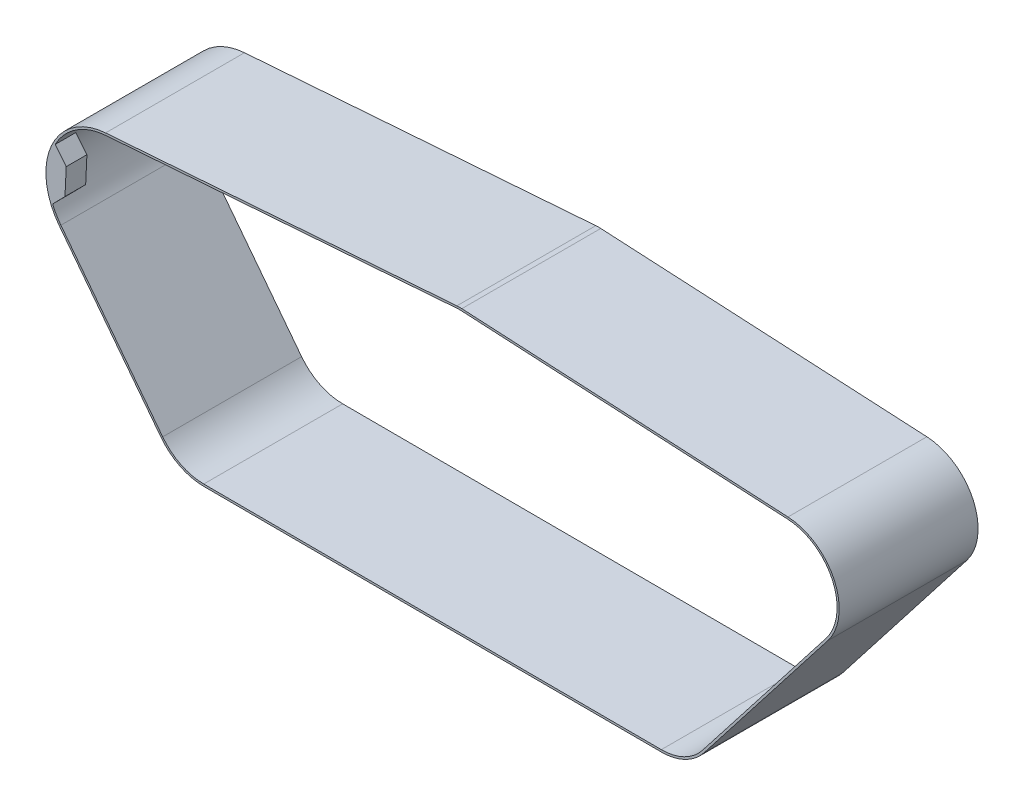
ISO-10303-21;
HEADER;
FILE_DESCRIPTION(('STEP AP214'),'2;1');
FILE_NAME('part.step','',(''),(''),'','','');
FILE_SCHEMA(('AUTOMOTIVE_DESIGN { 1 0 10303 214 1 1 1 1 }'));
ENDSEC;
DATA;
#1=APPLICATION_CONTEXT('core data for automotive mechanical design processes');
#2=APPLICATION_PROTOCOL_DEFINITION('international standard','automotive_design',2000,#1);
#3=PRODUCT_CONTEXT('',#1,'mechanical');
#4=PRODUCT('Part','Part','',(#3));
#5=PRODUCT_RELATED_PRODUCT_CATEGORY('part','',(#4));
#6=PRODUCT_DEFINITION_FORMATION('','',#4);
#7=PRODUCT_DEFINITION_CONTEXT('part definition',#1,'design');
#8=PRODUCT_DEFINITION('design','',#6,#7);
#9=PRODUCT_DEFINITION_SHAPE('','',#8);
#10=(LENGTH_UNIT() NAMED_UNIT(*) SI_UNIT(.MILLI.,.METRE.));
#11=(NAMED_UNIT(*) PLANE_ANGLE_UNIT() SI_UNIT($,.RADIAN.));
#12=(NAMED_UNIT(*) SI_UNIT($,.STERADIAN.) SOLID_ANGLE_UNIT());
#13=UNCERTAINTY_MEASURE_WITH_UNIT(LENGTH_MEASURE(1.E-05),#10,'distance_accuracy_value','');
#14=(GEOMETRIC_REPRESENTATION_CONTEXT(3) GLOBAL_UNCERTAINTY_ASSIGNED_CONTEXT((#13)) GLOBAL_UNIT_ASSIGNED_CONTEXT((#10,
#11,#12)) REPRESENTATION_CONTEXT('',''));
#15=CARTESIAN_POINT('',(0.,0.,0.));
#16=DIRECTION('',(0.,0.,1.));
#17=DIRECTION('',(1.,0.,0.));
#18=AXIS2_PLACEMENT_3D('',#15,#16,#17);
#19=CARTESIAN_POINT('',(2.22044604925031E-13,-1.346145417358E-12,23.5));
#20=DIRECTION('',(0.,0.,-1.));
#21=DIRECTION('',(-1.,0.,0.));
#22=AXIS2_PLACEMENT_3D('',#19,#20,#21);
#23=PLANE('',#22);
#24=DIRECTION('',(-0.630975539281231,0.77580272545845,0.));
#25=VECTOR('',#24,1.);
#26=CARTESIAN_POINT('',(-14.9213563464373,5.19549081248599,23.5));
#27=LINE('',#26,#25);
#28=CARTESIAN_POINT('',(-14.9213563464373,5.19549081248599,23.5));
#29=VERTEX_POINT('',#28);
#30=CARTESIAN_POINT('',(-18.6783253055227,9.81479310943626,23.5));
#31=VERTEX_POINT('',#30);
#32=EDGE_CURVE('E260',#29,#31,#27,.T.);
#33=ORIENTED_EDGE('',*,*,#32,.T.);
#34=CARTESIAN_POINT('',(2.22044604925031E-13,-1.346145417358E-12,23.5));
#35=DIRECTION('',(0.,0.,1.));
#36=DIRECTION('',(-1.,0.,0.));
#37=AXIS2_PLACEMENT_3D('',#34,#35,#36);
#38=CIRCLE('',#37,21.1);
#39=CARTESIAN_POINT('',(-1.55097310581208,21.0429200070948,23.5));
#40=VERTEX_POINT('',#39);
#41=EDGE_CURVE('E283',#40,#31,#38,.T.);
#42=ORIENTED_EDGE('',*,*,#41,.F.);
#43=DIRECTION('',(-0.997294787066168,-0.0735058343986872,0.));
#44=VECTOR('',#43,1.);
#45=CARTESIAN_POINT('',(-1.55097310581208,21.0429200070948,23.5));
#46=LINE('',#45,#44);
#47=CARTESIAN_POINT('',(117.314961243243,29.80396017217,23.5));
#48=VERTEX_POINT('',#47);
#49=EDGE_CURVE('E303',#48,#40,#46,.T.);
#50=ORIENTED_EDGE('',*,*,#49,.F.);
#51=CARTESIAN_POINT('',(118.241134756666,17.2380458551363,23.5));
#52=DIRECTION('',(0.,0.,1.));
#53=DIRECTION('',(-1.,0.,0.));
#54=AXIS2_PLACEMENT_3D('',#51,#52,#53);
#55=CIRCLE('',#54,12.6);
#56=CARTESIAN_POINT('',(118.910043209272,29.8202778305067,23.5));
#57=VERTEX_POINT('',#56);
#58=EDGE_CURVE('E300',#57,#48,#55,.T.);
#59=ORIENTED_EDGE('',*,*,#58,.F.);
#60=DIRECTION('',(-0.998589839315109,0.0530879724290279,0.));
#61=VECTOR('',#60,1.);
#62=CARTESIAN_POINT('',(118.910043209272,29.8202778305067,23.5));
#63=LINE('',#62,#61);
#64=CARTESIAN_POINT('',(229.262463920801,23.9536186301405,23.5));
#65=VERTEX_POINT('',#64);
#66=EDGE_CURVE('E298',#65,#57,#63,.T.);
#67=ORIENTED_EDGE('',*,*,#66,.F.);
#68=CARTESIAN_POINT('',(228.32811560605,6.37843745819464,23.5));
#69=DIRECTION('',(0.,0.,1.));
#70=DIRECTION('',(-1.,0.,0.));
#71=AXIS2_PLACEMENT_3D('',#68,#69,#70);
#72=CIRCLE('',#71,17.6);
#73=CARTESIAN_POINT('',(242.216182798249,-4.43274146294826,23.5));
#74=VERTEX_POINT('',#73);
#75=EDGE_CURVE('E296',#74,#65,#72,.T.);
#76=ORIENTED_EDGE('',*,*,#75,.F.);
#77=DIRECTION('',(0.614271529610392,0.789094726829491,0.));
#78=VECTOR('',#77,1.);
#79=CARTESIAN_POINT('',(242.216182798249,-4.43274146294826,23.5));
#80=LINE('',#79,#78);
#81=CARTESIAN_POINT('',(200.382727568324,-58.1721015598242,23.5));
#82=VERTEX_POINT('',#81);
#83=EDGE_CURVE('E294',#82,#74,#80,.T.);
#84=ORIENTED_EDGE('',*,*,#83,.F.);
#85=CARTESIAN_POINT('',(186.494660376125,-47.3609226386814,23.5));
#86=DIRECTION('',(0.,0.,1.));
#87=DIRECTION('',(-1.,0.,0.));
#88=AXIS2_PLACEMENT_3D('',#85,#86,#87);
#89=CIRCLE('',#88,17.6);
#90=CARTESIAN_POINT('',(186.445806411781,-64.9608548342941,23.5));
#91=VERTEX_POINT('',#90);
#92=EDGE_CURVE('E292',#91,#82,#89,.T.);
#93=ORIENTED_EDGE('',*,*,#92,.F.);
#94=DIRECTION('',(0.999996147478,-0.00277579342864236,0.));
#95=VECTOR('',#94,1.);
#96=CARTESIAN_POINT('',(186.445806411781,-64.9608548342941,23.5));
#97=LINE('',#96,#95);
#98=CARTESIAN_POINT('',(31.6218920570478,-64.5310939745684,23.5));
#99=VERTEX_POINT('',#98);
#100=EDGE_CURVE('E290',#99,#91,#97,.T.);
#101=ORIENTED_EDGE('',*,*,#100,.F.);
#102=CARTESIAN_POINT('',(31.6707460213919,-46.9311617789556,23.5));
#103=DIRECTION('',(0.,0.,1.));
#104=DIRECTION('',(-1.,0.,0.));
#105=AXIS2_PLACEMENT_3D('',#102,#103,#104);
#106=CIRCLE('',#105,17.6);
#107=CARTESIAN_POINT('',(17.7183914297212,-57.6592464797904,23.5));
#108=VERTEX_POINT('',#107);
#109=EDGE_CURVE('E288',#108,#99,#106,.T.);
#110=ORIENTED_EDGE('',*,*,#109,.F.);
#111=DIRECTION('',(0.609550267092885,-0.792747419981291,0.));
#112=VECTOR('',#111,1.);
#113=CARTESIAN_POINT('',(17.7183914297212,-57.6592464797904,23.5));
#114=LINE('',#113,#112);
#115=CARTESIAN_POINT('',(-16.726970561605,-12.8615106356612,23.5));
#116=VERTEX_POINT('',#115);
#117=EDGE_CURVE('E285',#116,#108,#114,.T.);
#118=ORIENTED_EDGE('',*,*,#117,.F.);
#119=CARTESIAN_POINT('',(-19.5159661992279,-8.02103879248869,23.5));
#120=VERTEX_POINT('',#119);
#121=EDGE_CURVE('E286',#120,#116,#38,.T.);
#122=ORIENTED_EDGE('',*,*,#121,.F.);
#123=DIRECTION('',(0.700907424340915,0.713252257272127,0.));
#124=VECTOR('',#123,1.);
#125=CARTESIAN_POINT('',(-15.3426072138043,-3.77417592103409,23.5));
#126=LINE('',#125,#124);
#127=CARTESIAN_POINT('',(-15.3426072138043,-3.77417592103409,23.5));
#128=VERTEX_POINT('',#127);
#129=EDGE_CURVE('E276',#120,#128,#126,.T.);
#130=ORIENTED_EDGE('',*,*,#129,.T.);
#131=DIRECTION('',(0.0469122308634259,0.998899015213959,0.));
#132=VECTOR('',#131,1.);
#133=CARTESIAN_POINT('',(-15.3426072138043,-3.77417592103409,23.5));
#134=LINE('',#133,#132);
#135=EDGE_CURVE('E266',#128,#29,#134,.T.);
#136=ORIENTED_EDGE('',*,*,#135,.T.);
#137=EDGE_LOOP('',(#33,#42,#50,#59,#67,#76,#84,#93,#101,#110,#118,#122,#130,#136));
#138=FACE_BOUND('',#137,.T.);
#139=CARTESIAN_POINT('',(2.22044604925031E-13,-1.346145417358E-12,23.5));
#140=DIRECTION('',(0.,0.,-1.));
#141=DIRECTION('',(-1.,0.,0.));
#142=AXIS2_PLACEMENT_3D('',#139,#140,#141);
#143=CIRCLE('',#142,21.8);
#144=CARTESIAN_POINT('',(-1.60242718989116,21.7410263580411,23.5));
#145=VERTEX_POINT('',#144);
#146=CARTESIAN_POINT('',(-17.2818937555919,-13.2881958226262,23.5));
#147=VERTEX_POINT('',#146);
#148=EDGE_CURVE('E357',#145,#147,#143,.F.);
#149=ORIENTED_EDGE('',*,*,#148,.T.);
#150=DIRECTION('',(0.609550267092885,-0.792747419981291,0.));
#151=VECTOR('',#150,1.);
#152=CARTESIAN_POINT('',(-17.2818937555919,-13.2881958226262,23.5));
#153=LINE('',#152,#151);
#154=CARTESIAN_POINT('',(17.1634682357343,-58.0859316667554,23.5));
#155=VERTEX_POINT('',#154);
#156=EDGE_CURVE('E359',#147,#155,#153,.T.);
#157=ORIENTED_EDGE('',*,*,#156,.T.);
#158=CARTESIAN_POINT('',(31.6707460213919,-46.9311617789556,23.5));
#159=DIRECTION('',(0.,0.,-1.));
#160=DIRECTION('',(-1.,0.,0.));
#161=AXIS2_PLACEMENT_3D('',#158,#159,#160);
#162=CIRCLE('',#161,18.3);
#163=CARTESIAN_POINT('',(31.6199490016477,-65.231091277803,23.5));
#164=VERTEX_POINT('',#163);
#165=EDGE_CURVE('E362',#155,#164,#162,.F.);
#166=ORIENTED_EDGE('',*,*,#165,.T.);
#167=DIRECTION('',(0.999996147478,-0.00277579342864236,0.));
#168=VECTOR('',#167,1.);
#169=CARTESIAN_POINT('',(-0.180823704314236,-65.1428185618275,23.5));
#170=LINE('',#169,#168);
#171=CARTESIAN_POINT('',(186.443863356381,-65.6608521375287,23.5));
#172=VERTEX_POINT('',#171);
#173=EDGE_CURVE('E364',#164,#172,#170,.T.);
#174=ORIENTED_EDGE('',*,*,#173,.T.);
#175=CARTESIAN_POINT('',(186.494660376125,-47.3609226386814,23.5));
#176=DIRECTION('',(0.,0.,-1.));
#177=DIRECTION('',(-1.,0.,0.));
#178=AXIS2_PLACEMENT_3D('',#175,#176,#177);
#179=CIRCLE('',#178,18.3);
#180=CARTESIAN_POINT('',(200.935093877105,-58.6020916305515,23.5));
#181=VERTEX_POINT('',#180);
#182=EDGE_CURVE('E366',#172,#181,#179,.F.);
#183=ORIENTED_EDGE('',*,*,#182,.T.);
#184=DIRECTION('',(0.614271529610392,0.789094726829491,0.));
#185=VECTOR('',#184,1.);
#186=CARTESIAN_POINT('',(153.521866491209,-119.509240845017,23.5));
#187=LINE('',#186,#185);
#188=CARTESIAN_POINT('',(242.76854910703,-4.86273153367553,23.5));
#189=VERTEX_POINT('',#188);
#190=EDGE_CURVE('E368',#181,#189,#187,.T.);
#191=ORIENTED_EDGE('',*,*,#190,.T.);
#192=CARTESIAN_POINT('',(228.32811560605,6.37843745819464,23.5));
#193=DIRECTION('',(0.,0.,-1.));
#194=DIRECTION('',(-1.,0.,0.));
#195=AXIS2_PLACEMENT_3D('',#192,#193,#194);
#196=CIRCLE('',#195,18.3);
#197=CARTESIAN_POINT('',(229.299625501501,24.6526315176611,23.5));
#198=VERTEX_POINT('',#197);
#199=EDGE_CURVE('E370',#189,#198,#196,.F.);
#200=ORIENTED_EDGE('',*,*,#199,.T.);
#201=DIRECTION('',(-0.998589839315109,0.053087972429028,0.));
#202=VECTOR('',#201,1.);
#203=CARTESIAN_POINT('',(1.9531553223125,36.7390384342261,23.5));
#204=LINE('',#203,#202);
#205=CARTESIAN_POINT('',(118.947204789972,30.5192907180273,23.5));
#206=VERTEX_POINT('',#205);
#207=EDGE_CURVE('E372',#198,#206,#204,.T.);
#208=ORIENTED_EDGE('',*,*,#207,.T.);
#209=CARTESIAN_POINT('',(118.241134756666,17.2380458551363,23.5));
#210=DIRECTION('',(0.,0.,-1.));
#211=DIRECTION('',(-1.,0.,0.));
#212=AXIS2_PLACEMENT_3D('',#209,#210,#211);
#213=CIRCLE('',#212,13.3);
#214=CARTESIAN_POINT('',(117.263507159164,30.5020665231164,23.5));
#215=VERTEX_POINT('',#214);
#216=EDGE_CURVE('E374',#206,#215,#213,.F.);
#217=ORIENTED_EDGE('',*,*,#216,.T.);
#218=DIRECTION('',(-0.997294787066168,-0.0735058343986872,0.));
#219=VECTOR('',#218,1.);
#220=CARTESIAN_POINT('',(-1.60242718989116,21.7410263580411,23.5));
#221=LINE('',#220,#219);
#222=EDGE_CURVE('E376',#215,#145,#221,.T.);
#223=ORIENTED_EDGE('',*,*,#222,.T.);
#224=EDGE_LOOP('',(#149,#157,#166,#174,#183,#191,#200,#208,#217,#223));
#225=FACE_BOUND('',#224,.T.);
#226=ADVANCED_FACE('F93',(#138,#225),#23,.F.);
#227=CARTESIAN_POINT('',(2.22044604925031E-13,-1.346145417358E-12,-23.5));
#228=DIRECTION('',(0.,0.,-1.));
#229=DIRECTION('',(-1.,0.,0.));
#230=AXIS2_PLACEMENT_3D('',#227,#228,#229);
#231=PLANE('',#230);
#232=CARTESIAN_POINT('',(2.22044604925031E-13,-1.346145417358E-12,-23.5));
#233=DIRECTION('',(0.,0.,-1.));
#234=DIRECTION('',(-1.,0.,0.));
#235=AXIS2_PLACEMENT_3D('',#232,#233,#234);
#236=CIRCLE('',#235,21.8);
#237=CARTESIAN_POINT('',(-1.60242718989116,21.7410263580411,-23.5));
#238=VERTEX_POINT('',#237);
#239=CARTESIAN_POINT('',(-17.2818937555919,-13.2881958226262,-23.5));
#240=VERTEX_POINT('',#239);
#241=EDGE_CURVE('E356',#238,#240,#236,.F.);
#242=ORIENTED_EDGE('',*,*,#241,.F.);
#243=DIRECTION('',(-0.997294787066168,-0.0735058343986872,0.));
#244=VECTOR('',#243,1.);
#245=CARTESIAN_POINT('',(-1.60242718989116,21.7410263580411,-23.5));
#246=LINE('',#245,#244);
#247=CARTESIAN_POINT('',(117.263507159164,30.5020665231164,-23.5));
#248=VERTEX_POINT('',#247);
#249=EDGE_CURVE('E360',#248,#238,#246,.T.);
#250=ORIENTED_EDGE('',*,*,#249,.F.);
#251=CARTESIAN_POINT('',(118.241134756666,17.2380458551363,-23.5));
#252=DIRECTION('',(0.,0.,-1.));
#253=DIRECTION('',(-1.,0.,0.));
#254=AXIS2_PLACEMENT_3D('',#251,#252,#253);
#255=CIRCLE('',#254,13.3);
#256=CARTESIAN_POINT('',(118.947204789972,30.5192907180273,-23.5));
#257=VERTEX_POINT('',#256);
#258=EDGE_CURVE('E395',#257,#248,#255,.F.);
#259=ORIENTED_EDGE('',*,*,#258,.F.);
#260=DIRECTION('',(-0.998589839315109,0.053087972429028,0.));
#261=VECTOR('',#260,1.);
#262=CARTESIAN_POINT('',(1.9531553223125,36.7390384342261,-23.5));
#263=LINE('',#262,#261);
#264=CARTESIAN_POINT('',(229.299625501501,24.6526315176611,-23.5));
#265=VERTEX_POINT('',#264);
#266=EDGE_CURVE('E393',#265,#257,#263,.T.);
#267=ORIENTED_EDGE('',*,*,#266,.F.);
#268=CARTESIAN_POINT('',(228.32811560605,6.37843745819464,-23.5));
#269=DIRECTION('',(0.,0.,-1.));
#270=DIRECTION('',(-1.,0.,0.));
#271=AXIS2_PLACEMENT_3D('',#268,#269,#270);
#272=CIRCLE('',#271,18.3);
#273=CARTESIAN_POINT('',(242.76854910703,-4.86273153367553,-23.5));
#274=VERTEX_POINT('',#273);
#275=EDGE_CURVE('E391',#274,#265,#272,.F.);
#276=ORIENTED_EDGE('',*,*,#275,.F.);
#277=DIRECTION('',(0.614271529610392,0.789094726829491,0.));
#278=VECTOR('',#277,1.);
#279=CARTESIAN_POINT('',(153.521866491209,-119.509240845017,-23.5));
#280=LINE('',#279,#278);
#281=CARTESIAN_POINT('',(200.935093877105,-58.6020916305515,-23.5));
#282=VERTEX_POINT('',#281);
#283=EDGE_CURVE('E389',#282,#274,#280,.T.);
#284=ORIENTED_EDGE('',*,*,#283,.F.);
#285=CARTESIAN_POINT('',(186.494660376125,-47.3609226386814,-23.5));
#286=DIRECTION('',(0.,0.,-1.));
#287=DIRECTION('',(-1.,0.,0.));
#288=AXIS2_PLACEMENT_3D('',#285,#286,#287);
#289=CIRCLE('',#288,18.3);
#290=CARTESIAN_POINT('',(186.443863356381,-65.6608521375287,-23.5));
#291=VERTEX_POINT('',#290);
#292=EDGE_CURVE('E387',#291,#282,#289,.F.);
#293=ORIENTED_EDGE('',*,*,#292,.F.);
#294=DIRECTION('',(0.999996147478,-0.00277579342864236,0.));
#295=VECTOR('',#294,1.);
#296=CARTESIAN_POINT('',(-0.180823704314236,-65.1428185618275,-23.5));
#297=LINE('',#296,#295);
#298=CARTESIAN_POINT('',(31.6199490016477,-65.231091277803,-23.5));
#299=VERTEX_POINT('',#298);
#300=EDGE_CURVE('E385',#299,#291,#297,.T.);
#301=ORIENTED_EDGE('',*,*,#300,.F.);
#302=CARTESIAN_POINT('',(31.6707460213919,-46.9311617789556,-23.5));
#303=DIRECTION('',(0.,0.,-1.));
#304=DIRECTION('',(-1.,0.,0.));
#305=AXIS2_PLACEMENT_3D('',#302,#303,#304);
#306=CIRCLE('',#305,18.3);
#307=CARTESIAN_POINT('',(17.1634682357343,-58.0859316667554,-23.5));
#308=VERTEX_POINT('',#307);
#309=EDGE_CURVE('E383',#308,#299,#306,.F.);
#310=ORIENTED_EDGE('',*,*,#309,.F.);
#311=DIRECTION('',(0.609550267092885,-0.792747419981291,0.));
#312=VECTOR('',#311,1.);
#313=CARTESIAN_POINT('',(-17.2818937555919,-13.2881958226262,-23.5));
#314=LINE('',#313,#312);
#315=EDGE_CURVE('E381',#240,#308,#314,.T.);
#316=ORIENTED_EDGE('',*,*,#315,.F.);
#317=EDGE_LOOP('',(#242,#250,#259,#267,#276,#284,#293,#301,#310,#316));
#318=FACE_BOUND('',#317,.T.);
#319=DIRECTION('',(-0.997294787066168,-0.0735058343986872,0.));
#320=VECTOR('',#319,1.);
#321=CARTESIAN_POINT('',(-1.55097310581208,21.0429200070948,-23.5));
#322=LINE('',#321,#320);
#323=CARTESIAN_POINT('',(117.314961243243,29.80396017217,-23.5));
#324=VERTEX_POINT('',#323);
#325=CARTESIAN_POINT('',(-1.55097310581208,21.0429200070948,-23.5));
#326=VERTEX_POINT('',#325);
#327=EDGE_CURVE('E332',#324,#326,#322,.T.);
#328=ORIENTED_EDGE('',*,*,#327,.T.);
#329=CARTESIAN_POINT('',(2.22044604925031E-13,-1.346145417358E-12,-23.5));
#330=DIRECTION('',(0.,0.,1.));
#331=DIRECTION('',(-1.,0.,0.));
#332=AXIS2_PLACEMENT_3D('',#329,#330,#331);
#333=CIRCLE('',#332,21.1);
#334=CARTESIAN_POINT('',(-16.726970561605,-12.8615106356612,-23.5));
#335=VERTEX_POINT('',#334);
#336=EDGE_CURVE('E281',#326,#335,#333,.T.);
#337=ORIENTED_EDGE('',*,*,#336,.T.);
#338=DIRECTION('',(0.609550267092885,-0.792747419981291,0.));
#339=VECTOR('',#338,1.);
#340=CARTESIAN_POINT('',(17.7183914297212,-57.6592464797904,-23.5));
#341=LINE('',#340,#339);
#342=CARTESIAN_POINT('',(17.7183914297212,-57.6592464797904,-23.5));
#343=VERTEX_POINT('',#342);
#344=EDGE_CURVE('E308',#335,#343,#341,.T.);
#345=ORIENTED_EDGE('',*,*,#344,.T.);
#346=CARTESIAN_POINT('',(31.6707460213919,-46.9311617789556,-23.5));
#347=DIRECTION('',(0.,0.,1.));
#348=DIRECTION('',(-1.,0.,0.));
#349=AXIS2_PLACEMENT_3D('',#346,#347,#348);
#350=CIRCLE('',#349,17.6);
#351=CARTESIAN_POINT('',(31.6218920570478,-64.5310939745684,-23.5));
#352=VERTEX_POINT('',#351);
#353=EDGE_CURVE('E311',#343,#352,#350,.T.);
#354=ORIENTED_EDGE('',*,*,#353,.T.);
#355=DIRECTION('',(0.999996147478,-0.00277579342864236,0.));
#356=VECTOR('',#355,1.);
#357=CARTESIAN_POINT('',(186.445806411781,-64.9608548342941,-23.5));
#358=LINE('',#357,#356);
#359=CARTESIAN_POINT('',(186.445806411781,-64.9608548342941,-23.5));
#360=VERTEX_POINT('',#359);
#361=EDGE_CURVE('E314',#352,#360,#358,.T.);
#362=ORIENTED_EDGE('',*,*,#361,.T.);
#363=CARTESIAN_POINT('',(186.494660376125,-47.3609226386814,-23.5));
#364=DIRECTION('',(0.,0.,1.));
#365=DIRECTION('',(-1.,0.,0.));
#366=AXIS2_PLACEMENT_3D('',#363,#364,#365);
#367=CIRCLE('',#366,17.6);
#368=CARTESIAN_POINT('',(200.382727568324,-58.1721015598242,-23.5));
#369=VERTEX_POINT('',#368);
#370=EDGE_CURVE('E317',#360,#369,#367,.T.);
#371=ORIENTED_EDGE('',*,*,#370,.T.);
#372=DIRECTION('',(0.614271529610392,0.789094726829491,0.));
#373=VECTOR('',#372,1.);
#374=CARTESIAN_POINT('',(242.216182798249,-4.43274146294826,-23.5));
#375=LINE('',#374,#373);
#376=CARTESIAN_POINT('',(242.216182798249,-4.43274146294826,-23.5));
#377=VERTEX_POINT('',#376);
#378=EDGE_CURVE('E320',#369,#377,#375,.T.);
#379=ORIENTED_EDGE('',*,*,#378,.T.);
#380=CARTESIAN_POINT('',(228.32811560605,6.37843745819464,-23.5));
#381=DIRECTION('',(0.,0.,1.));
#382=DIRECTION('',(-1.,0.,0.));
#383=AXIS2_PLACEMENT_3D('',#380,#381,#382);
#384=CIRCLE('',#383,17.6);
#385=CARTESIAN_POINT('',(229.262463920801,23.9536186301405,-23.5));
#386=VERTEX_POINT('',#385);
#387=EDGE_CURVE('E323',#377,#386,#384,.T.);
#388=ORIENTED_EDGE('',*,*,#387,.T.);
#389=DIRECTION('',(-0.998589839315109,0.0530879724290279,0.));
#390=VECTOR('',#389,1.);
#391=CARTESIAN_POINT('',(118.910043209272,29.8202778305067,-23.5));
#392=LINE('',#391,#390);
#393=CARTESIAN_POINT('',(118.910043209272,29.8202778305067,-23.5));
#394=VERTEX_POINT('',#393);
#395=EDGE_CURVE('E326',#386,#394,#392,.T.);
#396=ORIENTED_EDGE('',*,*,#395,.T.);
#397=CARTESIAN_POINT('',(118.241134756666,17.2380458551363,-23.5));
#398=DIRECTION('',(0.,0.,1.));
#399=DIRECTION('',(-1.,0.,0.));
#400=AXIS2_PLACEMENT_3D('',#397,#398,#399);
#401=CIRCLE('',#400,12.6);
#402=EDGE_CURVE('E329',#394,#324,#401,.T.);
#403=ORIENTED_EDGE('',*,*,#402,.T.);
#404=EDGE_LOOP('',(#328,#337,#345,#354,#362,#371,#379,#388,#396,#403));
#405=FACE_BOUND('',#404,.T.);
#406=ADVANCED_FACE('F438',(#318,#405),#231,.T.);
#407=CARTESIAN_POINT('',(2.22044604925031E-13,-1.346145417358E-12,23.5));
#408=DIRECTION('',(0.,0.,-1.));
#409=DIRECTION('',(-1.,0.,0.));
#410=AXIS2_PLACEMENT_3D('',#407,#408,#409);
#411=CYLINDRICAL_SURFACE('',#410,21.8);
#412=DIRECTION('',(0.,0.,-1.));
#413=VECTOR('',#412,1.);
#414=CARTESIAN_POINT('',(-17.2818937555919,-13.2881958226262,23.5));
#415=LINE('',#414,#413);
#416=EDGE_CURVE('E424',#147,#240,#415,.T.);
#417=ORIENTED_EDGE('',*,*,#416,.F.);
#418=ORIENTED_EDGE('',*,*,#148,.F.);
#419=DIRECTION('',(0.,0.,-1.));
#420=VECTOR('',#419,1.);
#421=CARTESIAN_POINT('',(-1.60242718989116,21.7410263580411,23.5));
#422=LINE('',#421,#420);
#423=EDGE_CURVE('E378',#145,#238,#422,.T.);
#424=ORIENTED_EDGE('',*,*,#423,.T.);
#425=ORIENTED_EDGE('',*,*,#241,.T.);
#426=EDGE_LOOP('',(#417,#418,#424,#425));
#427=FACE_BOUND('',#426,.T.);
#428=ADVANCED_FACE('F95',(#427),#411,.T.);
#429=CARTESIAN_POINT('',(-17.2818937555919,-13.2881958226262,23.5));
#430=DIRECTION('',(0.792747419981291,0.609550267092885,0.));
#431=DIRECTION('',(-0.609550267092885,0.792747419981291,0.));
#432=AXIS2_PLACEMENT_3D('',#429,#430,#431);
#433=PLANE('',#432);
#434=ORIENTED_EDGE('',*,*,#315,.T.);
#435=DIRECTION('',(0.,0.,-1.));
#436=VECTOR('',#435,1.);
#437=CARTESIAN_POINT('',(17.1634682357343,-58.0859316667554,23.5));
#438=LINE('',#437,#436);
#439=EDGE_CURVE('E421',#155,#308,#438,.T.);
#440=ORIENTED_EDGE('',*,*,#439,.F.);
#441=ORIENTED_EDGE('',*,*,#156,.F.);
#442=ORIENTED_EDGE('',*,*,#416,.T.);
#443=EDGE_LOOP('',(#434,#440,#441,#442));
#444=FACE_BOUND('',#443,.T.);
#445=ADVANCED_FACE('F430',(#444),#433,.F.);
#446=CARTESIAN_POINT('',(31.6707460213919,-46.9311617789556,23.5));
#447=DIRECTION('',(0.,0.,-1.));
#448=DIRECTION('',(-1.,0.,0.));
#449=AXIS2_PLACEMENT_3D('',#446,#447,#448);
#450=CYLINDRICAL_SURFACE('',#449,18.3);
#451=ORIENTED_EDGE('',*,*,#309,.T.);
#452=DIRECTION('',(0.,0.,-1.));
#453=VECTOR('',#452,1.);
#454=CARTESIAN_POINT('',(31.6199490016477,-65.231091277803,23.5));
#455=LINE('',#454,#453);
#456=EDGE_CURVE('E418',#164,#299,#455,.T.);
#457=ORIENTED_EDGE('',*,*,#456,.F.);
#458=ORIENTED_EDGE('',*,*,#165,.F.);
#459=ORIENTED_EDGE('',*,*,#439,.T.);
#460=EDGE_LOOP('',(#451,#457,#458,#459));
#461=FACE_BOUND('',#460,.T.);
#462=ADVANCED_FACE('F446',(#461),#450,.T.);
#463=CARTESIAN_POINT('',(-0.180823704314236,-65.1428185618275,23.5));
#464=DIRECTION('',(0.00277579342864236,0.999996147478,0.));
#465=DIRECTION('',(-0.999996147478,0.00277579342864236,0.));
#466=AXIS2_PLACEMENT_3D('',#463,#464,#465);
#467=PLANE('',#466);
#468=ORIENTED_EDGE('',*,*,#300,.T.);
#469=DIRECTION('',(0.,0.,-1.));
#470=VECTOR('',#469,1.);
#471=CARTESIAN_POINT('',(186.443863356381,-65.6608521375287,23.5));
#472=LINE('',#471,#470);
#473=EDGE_CURVE('E415',#172,#291,#472,.T.);
#474=ORIENTED_EDGE('',*,*,#473,.F.);
#475=ORIENTED_EDGE('',*,*,#173,.F.);
#476=ORIENTED_EDGE('',*,*,#456,.T.);
#477=EDGE_LOOP('',(#468,#474,#475,#476));
#478=FACE_BOUND('',#477,.T.);
#479=ADVANCED_FACE('F450',(#478),#467,.F.);
#480=CARTESIAN_POINT('',(186.494660376125,-47.3609226386814,23.5));
#481=DIRECTION('',(0.,0.,-1.));
#482=DIRECTION('',(-1.,0.,0.));
#483=AXIS2_PLACEMENT_3D('',#480,#481,#482);
#484=CYLINDRICAL_SURFACE('',#483,18.3);
#485=ORIENTED_EDGE('',*,*,#292,.T.);
#486=DIRECTION('',(0.,0.,-1.));
#487=VECTOR('',#486,1.);
#488=CARTESIAN_POINT('',(200.935093877105,-58.6020916305515,23.5));
#489=LINE('',#488,#487);
#490=EDGE_CURVE('E412',#181,#282,#489,.T.);
#491=ORIENTED_EDGE('',*,*,#490,.F.);
#492=ORIENTED_EDGE('',*,*,#182,.F.);
#493=ORIENTED_EDGE('',*,*,#473,.T.);
#494=EDGE_LOOP('',(#485,#491,#492,#493));
#495=FACE_BOUND('',#494,.T.);
#496=ADVANCED_FACE('F478',(#495),#484,.T.);
#497=CARTESIAN_POINT('',(153.521866491209,-119.509240845017,23.5));
#498=DIRECTION('',(-0.789094726829491,0.614271529610392,0.));
#499=DIRECTION('',(-0.614271529610392,-0.789094726829491,0.));
#500=AXIS2_PLACEMENT_3D('',#497,#498,#499);
#501=PLANE('',#500);
#502=ORIENTED_EDGE('',*,*,#283,.T.);
#503=DIRECTION('',(0.,0.,-1.));
#504=VECTOR('',#503,1.);
#505=CARTESIAN_POINT('',(242.76854910703,-4.86273153367553,23.5));
#506=LINE('',#505,#504);
#507=EDGE_CURVE('E409',#189,#274,#506,.T.);
#508=ORIENTED_EDGE('',*,*,#507,.F.);
#509=ORIENTED_EDGE('',*,*,#190,.F.);
#510=ORIENTED_EDGE('',*,*,#490,.T.);
#511=EDGE_LOOP('',(#502,#508,#509,#510));
#512=FACE_BOUND('',#511,.T.);
#513=ADVANCED_FACE('F476',(#512),#501,.F.);
#514=CARTESIAN_POINT('',(228.32811560605,6.37843745819464,23.5));
#515=DIRECTION('',(0.,0.,-1.));
#516=DIRECTION('',(-1.,0.,0.));
#517=AXIS2_PLACEMENT_3D('',#514,#515,#516);
#518=CYLINDRICAL_SURFACE('',#517,18.3);
#519=ORIENTED_EDGE('',*,*,#275,.T.);
#520=DIRECTION('',(0.,0.,-1.));
#521=VECTOR('',#520,1.);
#522=CARTESIAN_POINT('',(229.299625501501,24.6526315176611,23.5));
#523=LINE('',#522,#521);
#524=EDGE_CURVE('E406',#198,#265,#523,.T.);
#525=ORIENTED_EDGE('',*,*,#524,.F.);
#526=ORIENTED_EDGE('',*,*,#199,.F.);
#527=ORIENTED_EDGE('',*,*,#507,.T.);
#528=EDGE_LOOP('',(#519,#525,#526,#527));
#529=FACE_BOUND('',#528,.T.);
#530=ADVANCED_FACE('F472',(#529),#518,.T.);
#531=CARTESIAN_POINT('',(1.9531553223125,36.7390384342261,23.5));
#532=DIRECTION('',(-0.0530879724290279,-0.998589839315109,0.));
#533=DIRECTION('',(0.998589839315109,-0.053087972429028,0.));
#534=AXIS2_PLACEMENT_3D('',#531,#532,#533);
#535=PLANE('',#534);
#536=ORIENTED_EDGE('',*,*,#266,.T.);
#537=DIRECTION('',(0.,0.,-1.));
#538=VECTOR('',#537,1.);
#539=CARTESIAN_POINT('',(118.947204789972,30.5192907180273,23.5));
#540=LINE('',#539,#538);
#541=EDGE_CURVE('E403',#206,#257,#540,.T.);
#542=ORIENTED_EDGE('',*,*,#541,.F.);
#543=ORIENTED_EDGE('',*,*,#207,.F.);
#544=ORIENTED_EDGE('',*,*,#524,.T.);
#545=EDGE_LOOP('',(#536,#542,#543,#544));
#546=FACE_BOUND('',#545,.T.);
#547=ADVANCED_FACE('F467',(#546),#535,.F.);
#548=CARTESIAN_POINT('',(118.241134756666,17.2380458551363,23.5));
#549=DIRECTION('',(0.,0.,-1.));
#550=DIRECTION('',(-1.,0.,0.));
#551=AXIS2_PLACEMENT_3D('',#548,#549,#550);
#552=CYLINDRICAL_SURFACE('',#551,13.3);
#553=ORIENTED_EDGE('',*,*,#258,.T.);
#554=DIRECTION('',(0.,0.,-1.));
#555=VECTOR('',#554,1.);
#556=CARTESIAN_POINT('',(117.263507159164,30.5020665231164,23.5));
#557=LINE('',#556,#555);
#558=EDGE_CURVE('E400',#215,#248,#557,.T.);
#559=ORIENTED_EDGE('',*,*,#558,.F.);
#560=ORIENTED_EDGE('',*,*,#216,.F.);
#561=ORIENTED_EDGE('',*,*,#541,.T.);
#562=EDGE_LOOP('',(#553,#559,#560,#561));
#563=FACE_BOUND('',#562,.T.);
#564=ADVANCED_FACE('F461',(#563),#552,.T.);
#565=CARTESIAN_POINT('',(-1.60242718989116,21.7410263580411,23.5));
#566=DIRECTION('',(0.0735058343986872,-0.997294787066168,0.));
#567=DIRECTION('',(0.997294787066168,0.0735058343986872,0.));
#568=AXIS2_PLACEMENT_3D('',#565,#566,#567);
#569=PLANE('',#568);
#570=ORIENTED_EDGE('',*,*,#249,.T.);
#571=ORIENTED_EDGE('',*,*,#423,.F.);
#572=ORIENTED_EDGE('',*,*,#222,.F.);
#573=ORIENTED_EDGE('',*,*,#558,.T.);
#574=EDGE_LOOP('',(#570,#571,#572,#573));
#575=FACE_BOUND('',#574,.T.);
#576=ADVANCED_FACE('F459',(#575),#569,.F.);
#577=CARTESIAN_POINT('',(2.22044604925031E-13,-1.346145417358E-12,23.5));
#578=DIRECTION('',(0.,0.,-1.));
#579=DIRECTION('',(-1.,0.,0.));
#580=AXIS2_PLACEMENT_3D('',#577,#578,#579);
#581=CYLINDRICAL_SURFACE('',#580,21.1);
#582=DIRECTION('',(0.,0.,-1.));
#583=VECTOR('',#582,1.);
#584=CARTESIAN_POINT('',(-18.6783253055227,9.81479310943626,23.5));
#585=LINE('',#584,#583);
#586=CARTESIAN_POINT('',(-18.6783253055227,9.81479310943625,16.5));
#587=VERTEX_POINT('',#586);
#588=EDGE_CURVE('E12',#587,#31,#585,.F.);
#589=ORIENTED_EDGE('',*,*,#588,.F.);
#590=CARTESIAN_POINT('',(2.22044604925031E-13,-1.346145417358E-12,16.5));
#591=DIRECTION('',(0.,0.,1.));
#592=DIRECTION('',(1.,0.,0.));
#593=AXIS2_PLACEMENT_3D('',#590,#591,#592);
#594=CIRCLE('',#593,21.1);
#595=CARTESIAN_POINT('',(-19.5159661992279,-8.02103879248869,16.5));
#596=VERTEX_POINT('',#595);
#597=EDGE_CURVE('E108',#587,#596,#594,.T.);
#598=ORIENTED_EDGE('',*,*,#597,.T.);
#599=DIRECTION('',(0.,0.,-1.));
#600=VECTOR('',#599,1.);
#601=CARTESIAN_POINT('',(-19.5159661992279,-8.02103879248869,23.5));
#602=LINE('',#601,#600);
#603=EDGE_CURVE('E101',#120,#596,#602,.T.);
#604=ORIENTED_EDGE('',*,*,#603,.F.);
#605=ORIENTED_EDGE('',*,*,#121,.T.);
#606=DIRECTION('',(0.,0.,-1.));
#607=VECTOR('',#606,1.);
#608=CARTESIAN_POINT('',(-16.726970561605,-12.8615106356612,23.5));
#609=LINE('',#608,#607);
#610=EDGE_CURVE('E353',#116,#335,#609,.T.);
#611=ORIENTED_EDGE('',*,*,#610,.T.);
#612=ORIENTED_EDGE('',*,*,#336,.F.);
#613=DIRECTION('',(0.,0.,-1.));
#614=VECTOR('',#613,1.);
#615=CARTESIAN_POINT('',(-1.55097310581208,21.0429200070948,23.5));
#616=LINE('',#615,#614);
#617=EDGE_CURVE('E305',#40,#326,#616,.T.);
#618=ORIENTED_EDGE('',*,*,#617,.F.);
#619=ORIENTED_EDGE('',*,*,#41,.T.);
#620=EDGE_LOOP('',(#589,#598,#604,#605,#611,#612,#618,#619));
#621=FACE_BOUND('',#620,.T.);
#622=ADVANCED_FACE('F495',(#621),#581,.F.);
#623=CARTESIAN_POINT('',(17.7183914297212,-57.6592464797904,23.5));
#624=DIRECTION('',(0.792747419981291,0.609550267092885,0.));
#625=DIRECTION('',(-0.609550267092885,0.792747419981291,0.));
#626=AXIS2_PLACEMENT_3D('',#623,#624,#625);
#627=PLANE('',#626);
#628=ORIENTED_EDGE('',*,*,#344,.F.);
#629=ORIENTED_EDGE('',*,*,#610,.F.);
#630=ORIENTED_EDGE('',*,*,#117,.T.);
#631=DIRECTION('',(0.,0.,-1.));
#632=VECTOR('',#631,1.);
#633=CARTESIAN_POINT('',(17.7183914297212,-57.6592464797904,23.5));
#634=LINE('',#633,#632);
#635=EDGE_CURVE('E351',#108,#343,#634,.T.);
#636=ORIENTED_EDGE('',*,*,#635,.T.);
#637=EDGE_LOOP('',(#628,#629,#630,#636));
#638=FACE_BOUND('',#637,.T.);
#639=ADVANCED_FACE('F528',(#638),#627,.T.);
#640=CARTESIAN_POINT('',(31.6707460213919,-46.9311617789556,23.5));
#641=DIRECTION('',(0.,0.,-1.));
#642=DIRECTION('',(-1.,0.,0.));
#643=AXIS2_PLACEMENT_3D('',#640,#641,#642);
#644=CYLINDRICAL_SURFACE('',#643,17.6);
#645=ORIENTED_EDGE('',*,*,#353,.F.);
#646=ORIENTED_EDGE('',*,*,#635,.F.);
#647=ORIENTED_EDGE('',*,*,#109,.T.);
#648=DIRECTION('',(0.,0.,-1.));
#649=VECTOR('',#648,1.);
#650=CARTESIAN_POINT('',(31.6218920570478,-64.5310939745684,23.5));
#651=LINE('',#650,#649);
#652=EDGE_CURVE('E349',#99,#352,#651,.T.);
#653=ORIENTED_EDGE('',*,*,#652,.T.);
#654=EDGE_LOOP('',(#645,#646,#647,#653));
#655=FACE_BOUND('',#654,.T.);
#656=ADVANCED_FACE('F535',(#655),#644,.F.);
#657=CARTESIAN_POINT('',(186.445806411781,-64.9608548342941,23.5));
#658=DIRECTION('',(0.00277579342864236,0.999996147478,0.));
#659=DIRECTION('',(-0.999996147478,0.00277579342864236,0.));
#660=AXIS2_PLACEMENT_3D('',#657,#658,#659);
#661=PLANE('',#660);
#662=ORIENTED_EDGE('',*,*,#361,.F.);
#663=ORIENTED_EDGE('',*,*,#652,.F.);
#664=ORIENTED_EDGE('',*,*,#100,.T.);
#665=DIRECTION('',(0.,0.,-1.));
#666=VECTOR('',#665,1.);
#667=CARTESIAN_POINT('',(186.445806411781,-64.9608548342941,23.5));
#668=LINE('',#667,#666);
#669=EDGE_CURVE('E347',#91,#360,#668,.T.);
#670=ORIENTED_EDGE('',*,*,#669,.T.);
#671=EDGE_LOOP('',(#662,#663,#664,#670));
#672=FACE_BOUND('',#671,.T.);
#673=ADVANCED_FACE('F542',(#672),#661,.T.);
#674=CARTESIAN_POINT('',(186.494660376125,-47.3609226386814,23.5));
#675=DIRECTION('',(0.,0.,-1.));
#676=DIRECTION('',(-1.,0.,0.));
#677=AXIS2_PLACEMENT_3D('',#674,#675,#676);
#678=CYLINDRICAL_SURFACE('',#677,17.6);
#679=ORIENTED_EDGE('',*,*,#370,.F.);
#680=ORIENTED_EDGE('',*,*,#669,.F.);
#681=ORIENTED_EDGE('',*,*,#92,.T.);
#682=DIRECTION('',(0.,0.,-1.));
#683=VECTOR('',#682,1.);
#684=CARTESIAN_POINT('',(200.382727568324,-58.1721015598242,23.5));
#685=LINE('',#684,#683);
#686=EDGE_CURVE('E345',#82,#369,#685,.T.);
#687=ORIENTED_EDGE('',*,*,#686,.T.);
#688=EDGE_LOOP('',(#679,#680,#681,#687));
#689=FACE_BOUND('',#688,.T.);
#690=ADVANCED_FACE('F550',(#689),#678,.F.);
#691=CARTESIAN_POINT('',(242.216182798249,-4.43274146294826,23.5));
#692=DIRECTION('',(-0.789094726829491,0.614271529610392,0.));
#693=DIRECTION('',(-0.614271529610392,-0.789094726829491,0.));
#694=AXIS2_PLACEMENT_3D('',#691,#692,#693);
#695=PLANE('',#694);
#696=ORIENTED_EDGE('',*,*,#378,.F.);
#697=ORIENTED_EDGE('',*,*,#686,.F.);
#698=ORIENTED_EDGE('',*,*,#83,.T.);
#699=DIRECTION('',(0.,0.,-1.));
#700=VECTOR('',#699,1.);
#701=CARTESIAN_POINT('',(242.216182798249,-4.43274146294826,23.5));
#702=LINE('',#701,#700);
#703=EDGE_CURVE('E343',#74,#377,#702,.T.);
#704=ORIENTED_EDGE('',*,*,#703,.T.);
#705=EDGE_LOOP('',(#696,#697,#698,#704));
#706=FACE_BOUND('',#705,.T.);
#707=ADVANCED_FACE('F558',(#706),#695,.T.);
#708=CARTESIAN_POINT('',(228.32811560605,6.37843745819464,23.5));
#709=DIRECTION('',(0.,0.,-1.));
#710=DIRECTION('',(-1.,0.,0.));
#711=AXIS2_PLACEMENT_3D('',#708,#709,#710);
#712=CYLINDRICAL_SURFACE('',#711,17.6);
#713=ORIENTED_EDGE('',*,*,#387,.F.);
#714=ORIENTED_EDGE('',*,*,#703,.F.);
#715=ORIENTED_EDGE('',*,*,#75,.T.);
#716=DIRECTION('',(0.,0.,-1.));
#717=VECTOR('',#716,1.);
#718=CARTESIAN_POINT('',(229.262463920801,23.9536186301405,23.5));
#719=LINE('',#718,#717);
#720=EDGE_CURVE('E341',#65,#386,#719,.T.);
#721=ORIENTED_EDGE('',*,*,#720,.T.);
#722=EDGE_LOOP('',(#713,#714,#715,#721));
#723=FACE_BOUND('',#722,.T.);
#724=ADVANCED_FACE('F566',(#723),#712,.F.);
#725=CARTESIAN_POINT('',(118.910043209272,29.8202778305067,23.5));
#726=DIRECTION('',(-0.0530879724290279,-0.998589839315109,0.));
#727=DIRECTION('',(0.998589839315109,-0.0530879724290279,0.));
#728=AXIS2_PLACEMENT_3D('',#725,#726,#727);
#729=PLANE('',#728);
#730=ORIENTED_EDGE('',*,*,#395,.F.);
#731=ORIENTED_EDGE('',*,*,#720,.F.);
#732=ORIENTED_EDGE('',*,*,#66,.T.);
#733=DIRECTION('',(0.,0.,-1.));
#734=VECTOR('',#733,1.);
#735=CARTESIAN_POINT('',(118.910043209272,29.8202778305067,23.5));
#736=LINE('',#735,#734);
#737=EDGE_CURVE('E339',#57,#394,#736,.T.);
#738=ORIENTED_EDGE('',*,*,#737,.T.);
#739=EDGE_LOOP('',(#730,#731,#732,#738));
#740=FACE_BOUND('',#739,.T.);
#741=ADVANCED_FACE('F574',(#740),#729,.T.);
#742=CARTESIAN_POINT('',(118.241134756666,17.2380458551363,23.5));
#743=DIRECTION('',(0.,0.,-1.));
#744=DIRECTION('',(-1.,0.,0.));
#745=AXIS2_PLACEMENT_3D('',#742,#743,#744);
#746=CYLINDRICAL_SURFACE('',#745,12.6);
#747=ORIENTED_EDGE('',*,*,#402,.F.);
#748=ORIENTED_EDGE('',*,*,#737,.F.);
#749=ORIENTED_EDGE('',*,*,#58,.T.);
#750=DIRECTION('',(0.,0.,-1.));
#751=VECTOR('',#750,1.);
#752=CARTESIAN_POINT('',(117.314961243243,29.80396017217,23.5));
#753=LINE('',#752,#751);
#754=EDGE_CURVE('E337',#48,#324,#753,.T.);
#755=ORIENTED_EDGE('',*,*,#754,.T.);
#756=EDGE_LOOP('',(#747,#748,#749,#755));
#757=FACE_BOUND('',#756,.T.);
#758=ADVANCED_FACE('F582',(#757),#746,.F.);
#759=CARTESIAN_POINT('',(-1.55097310581208,21.0429200070948,23.5));
#760=DIRECTION('',(0.0735058343986872,-0.997294787066168,0.));
#761=DIRECTION('',(0.997294787066168,0.0735058343986872,0.));
#762=AXIS2_PLACEMENT_3D('',#759,#760,#761);
#763=PLANE('',#762);
#764=ORIENTED_EDGE('',*,*,#327,.F.);
#765=ORIENTED_EDGE('',*,*,#754,.F.);
#766=ORIENTED_EDGE('',*,*,#49,.T.);
#767=ORIENTED_EDGE('',*,*,#617,.T.);
#768=EDGE_LOOP('',(#764,#765,#766,#767));
#769=FACE_BOUND('',#768,.T.);
#770=ADVANCED_FACE('F590',(#769),#763,.T.);
#771=CARTESIAN_POINT('',(2.0122792321331E-13,0.,16.5));
#772=DIRECTION('',(0.,0.,1.));
#773=DIRECTION('',(1.,0.,0.));
#774=AXIS2_PLACEMENT_3D('',#771,#772,#773);
#775=PLANE('',#774);
#776=ORIENTED_EDGE('',*,*,#597,.F.);
#777=DIRECTION('',(-0.630975539281231,0.77580272545845,0.));
#778=VECTOR('',#777,1.);
#779=CARTESIAN_POINT('',(-14.9213563464373,5.19549081248599,16.5));
#780=LINE('',#779,#778);
#781=CARTESIAN_POINT('',(-14.9213563464373,5.19549081248599,16.5));
#782=VERTEX_POINT('',#781);
#783=EDGE_CURVE('E268',#782,#587,#780,.T.);
#784=ORIENTED_EDGE('',*,*,#783,.F.);
#785=DIRECTION('',(0.0469122308634259,0.998899015213959,0.));
#786=VECTOR('',#785,1.);
#787=CARTESIAN_POINT('',(-15.3426072138043,-3.77417592103409,16.5));
#788=LINE('',#787,#786);
#789=CARTESIAN_POINT('',(-15.3426072138043,-3.77417592103409,16.5));
#790=VERTEX_POINT('',#789);
#791=EDGE_CURVE('E259',#790,#782,#788,.T.);
#792=ORIENTED_EDGE('',*,*,#791,.F.);
#793=DIRECTION('',(0.700907424340915,0.713252257272127,0.));
#794=VECTOR('',#793,1.);
#795=CARTESIAN_POINT('',(-15.3426072138043,-3.77417592103409,16.5));
#796=LINE('',#795,#794);
#797=EDGE_CURVE('E251',#596,#790,#796,.T.);
#798=ORIENTED_EDGE('',*,*,#797,.F.);
#799=EDGE_LOOP('',(#776,#784,#792,#798));
#800=FACE_BOUND('',#799,.T.);
#801=ADVANCED_FACE('F271',(#800),#775,.F.);
#802=CARTESIAN_POINT('',(-14.9213563464373,5.19549081248599,16.5));
#803=DIRECTION('',(0.77580272545845,0.630975539281231,0.));
#804=DIRECTION('',(-0.630975539281231,0.77580272545845,0.));
#805=AXIS2_PLACEMENT_3D('',#802,#803,#804);
#806=PLANE('',#805);
#807=ORIENTED_EDGE('',*,*,#783,.T.);
#808=ORIENTED_EDGE('',*,*,#588,.T.);
#809=ORIENTED_EDGE('',*,*,#32,.F.);
#810=DIRECTION('',(0.,0.,1.));
#811=VECTOR('',#810,1.);
#812=CARTESIAN_POINT('',(-14.9213563464373,5.19549081248599,16.5));
#813=LINE('',#812,#811);
#814=EDGE_CURVE('E267',#782,#29,#813,.T.);
#815=ORIENTED_EDGE('',*,*,#814,.F.);
#816=EDGE_LOOP('',(#807,#808,#809,#815));
#817=FACE_BOUND('',#816,.T.);
#818=ADVANCED_FACE('F604',(#817),#806,.T.);
#819=CARTESIAN_POINT('',(-15.3426072138043,-3.77417592103409,16.5));
#820=DIRECTION('',(0.998899015213959,-0.0469122308634259,0.));
#821=DIRECTION('',(0.0469122308634259,0.998899015213959,0.));
#822=AXIS2_PLACEMENT_3D('',#819,#820,#821);
#823=PLANE('',#822);
#824=ORIENTED_EDGE('',*,*,#135,.F.);
#825=DIRECTION('',(0.,0.,1.));
#826=VECTOR('',#825,1.);
#827=CARTESIAN_POINT('',(-15.3426072138043,-3.77417592103409,16.5));
#828=LINE('',#827,#826);
#829=EDGE_CURVE('E255',#790,#128,#828,.T.);
#830=ORIENTED_EDGE('',*,*,#829,.F.);
#831=ORIENTED_EDGE('',*,*,#791,.T.);
#832=ORIENTED_EDGE('',*,*,#814,.T.);
#833=EDGE_LOOP('',(#824,#830,#831,#832));
#834=FACE_BOUND('',#833,.T.);
#835=ADVANCED_FACE('F264',(#834),#823,.T.);
#836=CARTESIAN_POINT('',(-15.3426072138043,-3.77417592103409,16.5));
#837=DIRECTION('',(0.713252257272127,-0.700907424340915,0.));
#838=DIRECTION('',(0.700907424340915,0.713252257272127,0.));
#839=AXIS2_PLACEMENT_3D('',#836,#837,#838);
#840=PLANE('',#839);
#841=ORIENTED_EDGE('',*,*,#129,.F.);
#842=ORIENTED_EDGE('',*,*,#603,.T.);
#843=ORIENTED_EDGE('',*,*,#797,.T.);
#844=ORIENTED_EDGE('',*,*,#829,.T.);
#845=EDGE_LOOP('',(#841,#842,#843,#844));
#846=FACE_BOUND('',#845,.T.);
#847=ADVANCED_FACE('F254',(#846),#840,.T.);
#848=CLOSED_SHELL('',(#226,#406,#428,#445,#462,#479,#496,#513,#530,#547,#564,#576,#622,#639,
#656,#673,#690,#707,#724,#741,#758,#770,#801,#818,#835,#847));
#849=MANIFOLD_SOLID_BREP('B2',#848);
#850=ADVANCED_BREP_SHAPE_REPRESENTATION('',(#18,#849),#14);
#851=SHAPE_DEFINITION_REPRESENTATION(#9,#850);
ENDSEC;
END-ISO-10303-21;
